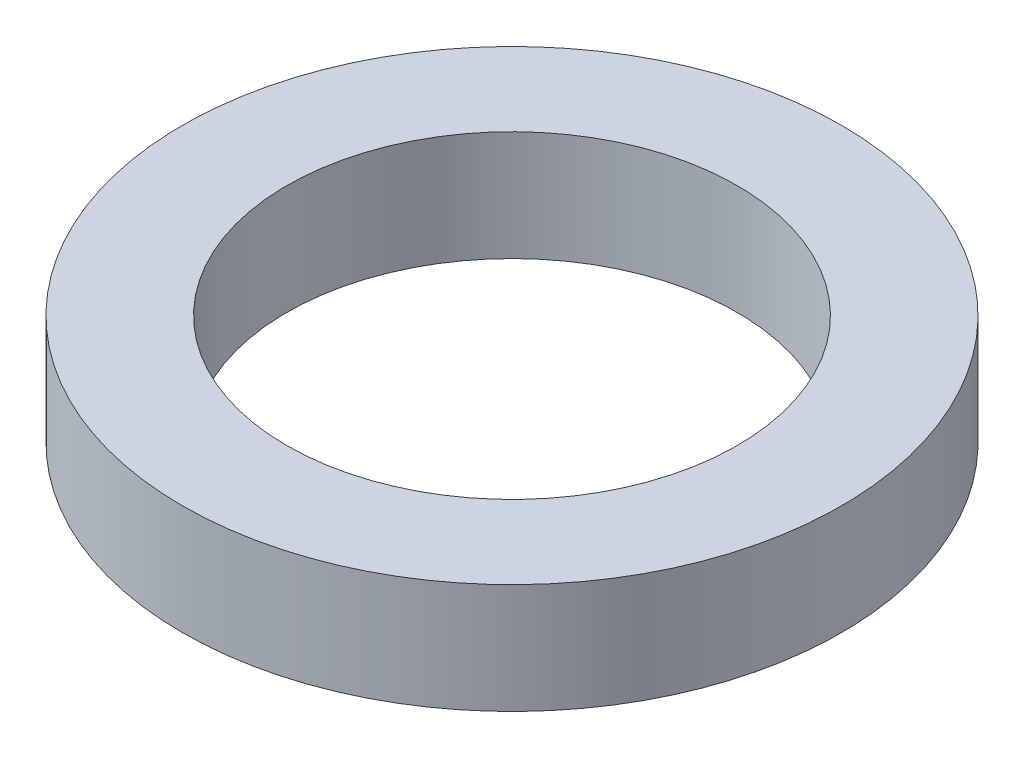
ISO-10303-21;
HEADER;
FILE_DESCRIPTION(('STEP AP214'),'2;1');
FILE_NAME('part.step','',(''),(''),'','','');
FILE_SCHEMA(('AUTOMOTIVE_DESIGN { 1 0 10303 214 1 1 1 1 }'));
ENDSEC;
DATA;
#1=APPLICATION_CONTEXT('core data for automotive mechanical design processes');
#2=APPLICATION_PROTOCOL_DEFINITION('international standard','automotive_design',2000,#1);
#3=PRODUCT_CONTEXT('',#1,'mechanical');
#4=PRODUCT('Part','Part','',(#3));
#5=PRODUCT_RELATED_PRODUCT_CATEGORY('part','',(#4));
#6=PRODUCT_DEFINITION_FORMATION('','',#4);
#7=PRODUCT_DEFINITION_CONTEXT('part definition',#1,'design');
#8=PRODUCT_DEFINITION('design','',#6,#7);
#9=PRODUCT_DEFINITION_SHAPE('','',#8);
#10=(LENGTH_UNIT() NAMED_UNIT(*) SI_UNIT(.MILLI.,.METRE.));
#11=(NAMED_UNIT(*) PLANE_ANGLE_UNIT() SI_UNIT($,.RADIAN.));
#12=(NAMED_UNIT(*) SI_UNIT($,.STERADIAN.) SOLID_ANGLE_UNIT());
#13=UNCERTAINTY_MEASURE_WITH_UNIT(LENGTH_MEASURE(1.E-05),#10,'distance_accuracy_value','');
#14=(GEOMETRIC_REPRESENTATION_CONTEXT(3) GLOBAL_UNCERTAINTY_ASSIGNED_CONTEXT((#13)) GLOBAL_UNIT_ASSIGNED_CONTEXT((#10,
#11,#12)) REPRESENTATION_CONTEXT('',''));
#15=CARTESIAN_POINT('',(0.,0.,0.));
#16=DIRECTION('',(0.,0.,1.));
#17=DIRECTION('',(1.,0.,0.));
#18=AXIS2_PLACEMENT_3D('',#15,#16,#17);
#19=CARTESIAN_POINT('',(0.,2.,0.));
#20=DIRECTION('',(0.,1.,0.));
#21=DIRECTION('',(0.,0.,1.));
#22=AXIS2_PLACEMENT_3D('',#19,#20,#21);
#23=PLANE('',#22);
#24=CARTESIAN_POINT('',(0.,2.,0.));
#25=DIRECTION('',(0.,1.,0.));
#26=DIRECTION('',(0.,0.,1.));
#27=AXIS2_PLACEMENT_3D('',#24,#25,#26);
#28=CIRCLE('',#27,6.);
#29=CARTESIAN_POINT('',(0.,2.,6.));
#30=VERTEX_POINT('',#29);
#31=EDGE_CURVE('E10',#30,#30,#28,.T.);
#32=ORIENTED_EDGE('',*,*,#31,.T.);
#33=EDGE_LOOP('',(#32));
#34=FACE_BOUND('',#33,.T.);
#35=CARTESIAN_POINT('',(0.,2.,0.));
#36=DIRECTION('',(0.,1.,0.));
#37=DIRECTION('',(0.,0.,1.));
#38=AXIS2_PLACEMENT_3D('',#35,#36,#37);
#39=CIRCLE('',#38,4.1);
#40=CARTESIAN_POINT('',(0.,2.,4.1));
#41=VERTEX_POINT('',#40);
#42=EDGE_CURVE('E50',#41,#41,#39,.T.);
#43=ORIENTED_EDGE('',*,*,#42,.F.);
#44=EDGE_LOOP('',(#43));
#45=FACE_BOUND('',#44,.T.);
#46=ADVANCED_FACE('F37',(#34,#45),#23,.T.);
#47=CARTESIAN_POINT('',(0.,0.,0.));
#48=DIRECTION('',(0.,1.,0.));
#49=DIRECTION('',(0.,0.,1.));
#50=AXIS2_PLACEMENT_3D('',#47,#48,#49);
#51=PLANE('',#50);
#52=CARTESIAN_POINT('',(0.,0.,0.));
#53=DIRECTION('',(0.,1.,0.));
#54=DIRECTION('',(0.,0.,1.));
#55=AXIS2_PLACEMENT_3D('',#52,#53,#54);
#56=CIRCLE('',#55,6.);
#57=CARTESIAN_POINT('',(0.,0.,6.));
#58=VERTEX_POINT('',#57);
#59=EDGE_CURVE('E41',#58,#58,#56,.T.);
#60=ORIENTED_EDGE('',*,*,#59,.F.);
#61=EDGE_LOOP('',(#60));
#62=FACE_BOUND('',#61,.T.);
#63=CARTESIAN_POINT('',(0.,0.,0.));
#64=DIRECTION('',(0.,1.,0.));
#65=DIRECTION('',(0.,0.,1.));
#66=AXIS2_PLACEMENT_3D('',#63,#64,#65);
#67=CIRCLE('',#66,4.1);
#68=CARTESIAN_POINT('',(0.,0.,4.1));
#69=VERTEX_POINT('',#68);
#70=EDGE_CURVE('E52',#69,#69,#67,.T.);
#71=ORIENTED_EDGE('',*,*,#70,.T.);
#72=EDGE_LOOP('',(#71));
#73=FACE_BOUND('',#72,.T.);
#74=ADVANCED_FACE('F64',(#62,#73),#51,.F.);
#75=CARTESIAN_POINT('',(0.,2.,0.));
#76=DIRECTION('',(0.,-1.,0.));
#77=DIRECTION('',(0.,0.,-1.));
#78=AXIS2_PLACEMENT_3D('',#75,#76,#77);
#79=CYLINDRICAL_SURFACE('',#78,6.);
#80=ORIENTED_EDGE('',*,*,#31,.F.);
#81=EDGE_LOOP('',(#80));
#82=FACE_BOUND('',#81,.T.);
#83=ORIENTED_EDGE('',*,*,#59,.T.);
#84=EDGE_LOOP('',(#83));
#85=FACE_BOUND('',#84,.T.);
#86=ADVANCED_FACE('F39',(#82,#85),#79,.T.);
#87=CARTESIAN_POINT('',(0.,2.,0.));
#88=DIRECTION('',(0.,-1.,0.));
#89=DIRECTION('',(0.,0.,-1.));
#90=AXIS2_PLACEMENT_3D('',#87,#88,#89);
#91=CYLINDRICAL_SURFACE('',#90,4.1);
#92=ORIENTED_EDGE('',*,*,#42,.T.);
#93=EDGE_LOOP('',(#92));
#94=FACE_BOUND('',#93,.T.);
#95=ORIENTED_EDGE('',*,*,#70,.F.);
#96=EDGE_LOOP('',(#95));
#97=FACE_BOUND('',#96,.T.);
#98=ADVANCED_FACE('F60',(#94,#97),#91,.F.);
#99=CLOSED_SHELL('',(#46,#74,#86,#98));
#100=MANIFOLD_SOLID_BREP('B2',#99);
#101=ADVANCED_BREP_SHAPE_REPRESENTATION('',(#18,#100),#14);
#102=SHAPE_DEFINITION_REPRESENTATION(#9,#101);
ENDSEC;
END-ISO-10303-21;
